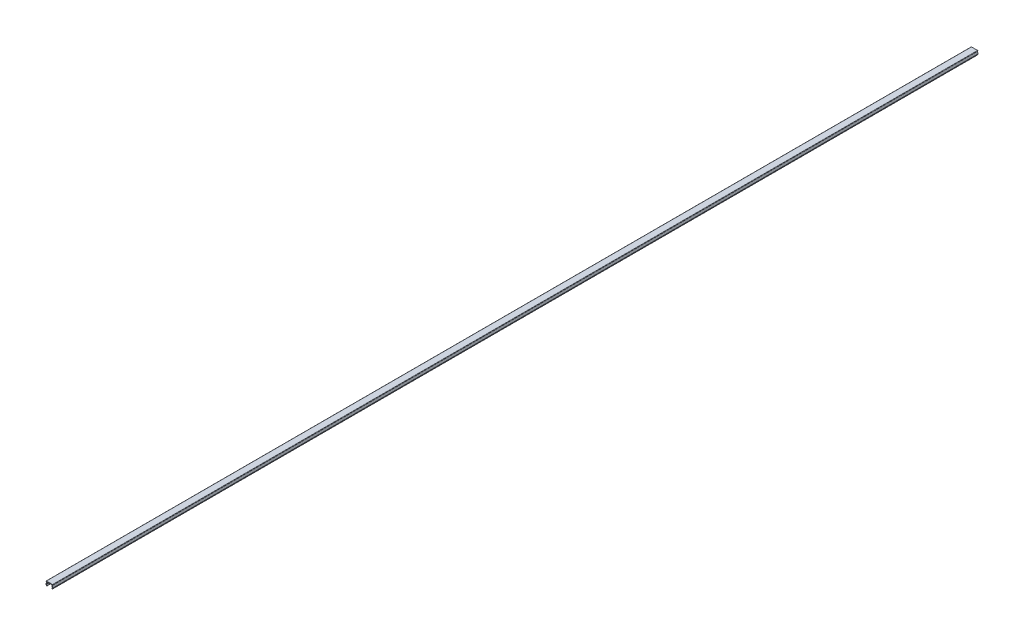
ISO-10303-21;
HEADER;
FILE_DESCRIPTION(('STEP AP214'),'2;1');
FILE_NAME('part.step','',(''),(''),'','','');
FILE_SCHEMA(('AUTOMOTIVE_DESIGN { 1 0 10303 214 1 1 1 1 }'));
ENDSEC;
DATA;
#1=APPLICATION_CONTEXT('core data for automotive mechanical design processes');
#2=APPLICATION_PROTOCOL_DEFINITION('international standard','automotive_design',2000,#1);
#3=PRODUCT_CONTEXT('',#1,'mechanical');
#4=PRODUCT('Part','Part','',(#3));
#5=PRODUCT_RELATED_PRODUCT_CATEGORY('part','',(#4));
#6=PRODUCT_DEFINITION_FORMATION('','',#4);
#7=PRODUCT_DEFINITION_CONTEXT('part definition',#1,'design');
#8=PRODUCT_DEFINITION('design','',#6,#7);
#9=PRODUCT_DEFINITION_SHAPE('','',#8);
#10=(LENGTH_UNIT() NAMED_UNIT(*) SI_UNIT(.MILLI.,.METRE.));
#11=(NAMED_UNIT(*) PLANE_ANGLE_UNIT() SI_UNIT($,.RADIAN.));
#12=(NAMED_UNIT(*) SI_UNIT($,.STERADIAN.) SOLID_ANGLE_UNIT());
#13=UNCERTAINTY_MEASURE_WITH_UNIT(LENGTH_MEASURE(1.E-05),#10,'distance_accuracy_value','');
#14=(GEOMETRIC_REPRESENTATION_CONTEXT(3) GLOBAL_UNCERTAINTY_ASSIGNED_CONTEXT((#13)) GLOBAL_UNIT_ASSIGNED_CONTEXT((#10,
#11,#12)) REPRESENTATION_CONTEXT('',''));
#15=CARTESIAN_POINT('',(0.,0.,0.));
#16=DIRECTION('',(0.,0.,1.));
#17=DIRECTION('',(1.,0.,0.));
#18=AXIS2_PLACEMENT_3D('',#15,#16,#17);
#19=CARTESIAN_POINT('',(-1.32833862518597,3.94999984480356,1000.));
#20=DIRECTION('',(0.,1.,0.));
#21=DIRECTION('',(0.,0.,1.));
#22=AXIS2_PLACEMENT_3D('',#19,#20,#21);
#23=PLANE('',#22);
#24=DIRECTION('',(0.,0.,-1.));
#25=VECTOR('',#24,1.);
#26=CARTESIAN_POINT('',(4.82913663774382,3.94999984480356,1000.));
#27=LINE('',#26,#25);
#28=CARTESIAN_POINT('',(4.82913663774382,3.94999984480356,1000.));
#29=VERTEX_POINT('',#28);
#30=CARTESIAN_POINT('',(4.82913663774382,3.94999984480356,0.));
#31=VERTEX_POINT('',#30);
#32=EDGE_CURVE('E161',#29,#31,#27,.T.);
#33=ORIENTED_EDGE('',*,*,#32,.F.);
#34=DIRECTION('',(1.,0.,0.));
#35=VECTOR('',#34,1.);
#36=CARTESIAN_POINT('',(-1.32833862518597,3.94999984480356,1000.));
#37=LINE('',#36,#35);
#38=CARTESIAN_POINT('',(-0.285813888115763,3.94999984480356,1000.));
#39=VERTEX_POINT('',#38);
#40=EDGE_CURVE('E231',#39,#29,#37,.T.);
#41=ORIENTED_EDGE('',*,*,#40,.F.);
#42=DIRECTION('',(0.,0.,-1.));
#43=VECTOR('',#42,1.);
#44=CARTESIAN_POINT('',(-0.285813888115763,3.94999984480356,1000.));
#45=LINE('',#44,#43);
#46=CARTESIAN_POINT('',(-0.285813888115763,3.94999984480356,0.));
#47=VERTEX_POINT('',#46);
#48=EDGE_CURVE('E244',#39,#47,#45,.T.);
#49=ORIENTED_EDGE('',*,*,#48,.T.);
#50=DIRECTION('',(1.,0.,0.));
#51=VECTOR('',#50,1.);
#52=CARTESIAN_POINT('',(-1.32833862518597,3.94999984480356,0.));
#53=LINE('',#52,#51);
#54=EDGE_CURVE('E239',#47,#31,#53,.T.);
#55=ORIENTED_EDGE('',*,*,#54,.T.);
#56=EDGE_LOOP('',(#33,#41,#49,#55));
#57=FACE_BOUND('',#56,.T.);
#58=ADVANCED_FACE('F15',(#57),#23,.F.);
#59=CARTESIAN_POINT('',(-1.02833862518597,3.94999984480356,1000.));
#60=VERTEX_POINT('',#59);
#61=CARTESIAN_POINT('',(-0.899434790827606,3.94999984480356,1000.));
#62=VERTEX_POINT('',#61);
#63=EDGE_CURVE('E228',#60,#62,#37,.T.);
#64=ORIENTED_EDGE('',*,*,#63,.F.);
#65=DIRECTION('',(0.,0.,-1.));
#66=VECTOR('',#65,1.);
#67=CARTESIAN_POINT('',(-1.02833862518597,3.94999984480356,0.));
#68=LINE('',#67,#66);
#69=CARTESIAN_POINT('',(-1.02833862518597,3.94999984480356,0.));
#70=VERTEX_POINT('',#69);
#71=EDGE_CURVE('E24',#60,#70,#68,.T.);
#72=ORIENTED_EDGE('',*,*,#71,.T.);
#73=CARTESIAN_POINT('',(-0.899434790827606,3.94999984480356,0.));
#74=VERTEX_POINT('',#73);
#75=EDGE_CURVE('E236',#70,#74,#53,.T.);
#76=ORIENTED_EDGE('',*,*,#75,.T.);
#77=DIRECTION('',(0.,0.,-1.));
#78=VECTOR('',#77,1.);
#79=CARTESIAN_POINT('',(-0.899434790827606,3.94999984480356,1000.));
#80=LINE('',#79,#78);
#81=EDGE_CURVE('E235',#62,#74,#80,.T.);
#82=ORIENTED_EDGE('',*,*,#81,.F.);
#83=EDGE_LOOP('',(#64,#72,#76,#82));
#84=FACE_BOUND('',#83,.T.);
#85=ADVANCED_FACE('F317',(#84),#23,.F.);
#86=CARTESIAN_POINT('',(5.44275754045566,3.94999984480356,0.));
#87=VERTEX_POINT('',#86);
#88=CARTESIAN_POINT('',(5.57166137481403,3.94999984480356,0.));
#89=VERTEX_POINT('',#88);
#90=EDGE_CURVE('E227',#87,#89,#53,.T.);
#91=ORIENTED_EDGE('',*,*,#90,.T.);
#92=DIRECTION('',(0.,0.,-1.));
#93=VECTOR('',#92,1.);
#94=CARTESIAN_POINT('',(5.57166137481403,3.94999984480356,1000.));
#95=LINE('',#94,#93);
#96=CARTESIAN_POINT('',(5.57166137481403,3.94999984480356,1000.));
#97=VERTEX_POINT('',#96);
#98=EDGE_CURVE('E9',#89,#97,#95,.F.);
#99=ORIENTED_EDGE('',*,*,#98,.T.);
#100=CARTESIAN_POINT('',(5.44275754045566,3.94999984480356,1000.));
#101=VERTEX_POINT('',#100);
#102=EDGE_CURVE('E232',#101,#97,#37,.T.);
#103=ORIENTED_EDGE('',*,*,#102,.F.);
#104=DIRECTION('',(0.,0.,-1.));
#105=VECTOR('',#104,1.);
#106=CARTESIAN_POINT('',(5.44275754045567,3.94999984480356,1000.));
#107=LINE('',#106,#105);
#108=EDGE_CURVE('E190',#101,#87,#107,.T.);
#109=ORIENTED_EDGE('',*,*,#108,.T.);
#110=EDGE_LOOP('',(#91,#99,#103,#109));
#111=FACE_BOUND('',#110,.T.);
#112=ADVANCED_FACE('F286',(#111),#23,.F.);
#113=CARTESIAN_POINT('',(-1.32833862518597,4.54999984480356,1000.));
#114=DIRECTION('',(0.,1.,0.));
#115=DIRECTION('',(0.,0.,1.));
#116=AXIS2_PLACEMENT_3D('',#113,#114,#115);
#117=PLANE('',#116);
#118=DIRECTION('',(1.,0.,0.));
#119=VECTOR('',#118,1.);
#120=CARTESIAN_POINT('',(-1.32833862518597,4.54999984480356,0.));
#121=LINE('',#120,#119);
#122=CARTESIAN_POINT('',(-1.02833862518597,4.54999984480356,0.));
#123=VERTEX_POINT('',#122);
#124=CARTESIAN_POINT('',(5.57166137481403,4.54999984480356,0.));
#125=VERTEX_POINT('',#124);
#126=EDGE_CURVE('E238',#123,#125,#121,.T.);
#127=ORIENTED_EDGE('',*,*,#126,.F.);
#128=DIRECTION('',(0.,0.,-1.));
#129=VECTOR('',#128,1.);
#130=CARTESIAN_POINT('',(-1.02833862518597,4.54999984480356,1000.));
#131=LINE('',#130,#129);
#132=CARTESIAN_POINT('',(-1.02833862518597,4.54999984480356,1000.));
#133=VERTEX_POINT('',#132);
#134=EDGE_CURVE('E257',#123,#133,#131,.F.);
#135=ORIENTED_EDGE('',*,*,#134,.T.);
#136=DIRECTION('',(1.,0.,0.));
#137=VECTOR('',#136,1.);
#138=CARTESIAN_POINT('',(-1.32833862518597,4.54999984480356,1000.));
#139=LINE('',#138,#137);
#140=CARTESIAN_POINT('',(5.57166137481403,4.54999984480356,1000.));
#141=VERTEX_POINT('',#140);
#142=EDGE_CURVE('E230',#133,#141,#139,.T.);
#143=ORIENTED_EDGE('',*,*,#142,.T.);
#144=DIRECTION('',(0.,0.,-1.));
#145=VECTOR('',#144,1.);
#146=CARTESIAN_POINT('',(5.57166137481403,4.54999984480356,1000.));
#147=LINE('',#146,#145);
#148=EDGE_CURVE('E254',#141,#125,#147,.T.);
#149=ORIENTED_EDGE('',*,*,#148,.T.);
#150=EDGE_LOOP('',(#127,#135,#143,#149));
#151=FACE_BOUND('',#150,.T.);
#152=ADVANCED_FACE('F326',(#151),#117,.T.);
#153=CARTESIAN_POINT('',(0.,0.,1000.));
#154=DIRECTION('',(0.,0.,-1.));
#155=DIRECTION('',(-1.,0.,0.));
#156=AXIS2_PLACEMENT_3D('',#153,#154,#155);
#157=PLANE('',#156);
#158=ORIENTED_EDGE('',*,*,#142,.F.);
#159=CARTESIAN_POINT('',(-1.02833862518597,4.24999984480356,1000.));
#160=DIRECTION('',(0.,0.,-1.));
#161=DIRECTION('',(-1.,0.,0.));
#162=AXIS2_PLACEMENT_3D('',#159,#160,#161);
#163=CIRCLE('',#162,0.3);
#164=CARTESIAN_POINT('',(-1.32833862518597,4.24999984480356,1000.));
#165=VERTEX_POINT('',#164);
#166=EDGE_CURVE('E37',#133,#165,#163,.F.);
#167=ORIENTED_EDGE('',*,*,#166,.T.);
#168=CARTESIAN_POINT('',(-1.02833862518597,4.24999984480356,1000.));
#169=DIRECTION('',(0.,0.,-1.));
#170=DIRECTION('',(-1.,0.,0.));
#171=AXIS2_PLACEMENT_3D('',#168,#169,#170);
#172=CIRCLE('',#171,0.3);
#173=EDGE_CURVE('E32',#165,#60,#172,.F.);
#174=ORIENTED_EDGE('',*,*,#173,.T.);
#175=ORIENTED_EDGE('',*,*,#63,.T.);
#176=DIRECTION('',(-0.209529088730873,-0.97780241407741,0.));
#177=VECTOR('',#176,1.);
#178=CARTESIAN_POINT('',(-0.821679349409193,4.31285857142282,1000.));
#179=LINE('',#178,#177);
#180=CARTESIAN_POINT('',(-1.44301852608376,1.4132757469415,1000.));
#181=VERTEX_POINT('',#180);
#182=EDGE_CURVE('E204',#62,#181,#179,.T.);
#183=ORIENTED_EDGE('',*,*,#182,.T.);
#184=DIRECTION('',(0.429056814568288,-0.90327750435429,0.));
#185=VECTOR('',#184,1.);
#186=CARTESIAN_POINT('',(-1.39932187649226,1.32128280043307,1000.));
#187=LINE('',#186,#185);
#188=CARTESIAN_POINT('',(-0.829321876492257,0.121282800433072,1000.));
#189=VERTEX_POINT('',#188);
#190=EDGE_CURVE('E193',#181,#189,#187,.T.);
#191=ORIENTED_EDGE('',*,*,#190,.T.);
#192=DIRECTION('',(-0.90327750435429,-0.429056814568287,0.));
#193=VECTOR('',#192,1.);
#194=CARTESIAN_POINT('',(-0.287355373879683,0.378716889174045,1000.));
#195=LINE('',#194,#193);
#196=CARTESIAN_POINT('',(-0.287355373879683,0.378716889174045,1000.));
#197=VERTEX_POINT('',#196);
#198=EDGE_CURVE('E195',#197,#189,#195,.T.);
#199=ORIENTED_EDGE('',*,*,#198,.F.);
#200=DIRECTION('',(0.429056814568288,-0.90327750435429,0.));
#201=VECTOR('',#200,1.);
#202=CARTESIAN_POINT('',(-0.857355373879683,1.57871688917404,1000.));
#203=LINE('',#202,#201);
#204=CARTESIAN_POINT('',(-0.813658724288179,1.48672394266561,1000.));
#205=VERTEX_POINT('',#204);
#206=EDGE_CURVE('E199',#205,#197,#203,.T.);
#207=ORIENTED_EDGE('',*,*,#206,.F.);
#208=DIRECTION('',(-0.209529088730873,-0.97780241407741,0.));
#209=VECTOR('',#208,1.);
#210=CARTESIAN_POINT('',(-0.234997900962748,4.1871411181843,1000.));
#211=LINE('',#210,#209);
#212=EDGE_CURVE('E202',#39,#205,#211,.T.);
#213=ORIENTED_EDGE('',*,*,#212,.F.);
#214=ORIENTED_EDGE('',*,*,#40,.T.);
#215=DIRECTION('',(0.209529088730874,-0.97780241407741,0.));
#216=VECTOR('',#215,1.);
#217=CARTESIAN_POINT('',(4.77832065059081,4.1871411181843,1000.));
#218=LINE('',#217,#216);
#219=CARTESIAN_POINT('',(5.35698147391624,1.48672394266562,1000.));
#220=VERTEX_POINT('',#219);
#221=EDGE_CURVE('E147',#29,#220,#218,.T.);
#222=ORIENTED_EDGE('',*,*,#221,.T.);
#223=DIRECTION('',(-0.429056814568288,-0.90327750435429,0.));
#224=VECTOR('',#223,1.);
#225=CARTESIAN_POINT('',(5.40067812350774,1.57871688917405,1000.));
#226=LINE('',#225,#224);
#227=CARTESIAN_POINT('',(4.83067812350774,0.378716889174045,1000.));
#228=VERTEX_POINT('',#227);
#229=EDGE_CURVE('E138',#220,#228,#226,.T.);
#230=ORIENTED_EDGE('',*,*,#229,.T.);
#231=DIRECTION('',(-0.90327750435429,0.429056814568287,0.));
#232=VECTOR('',#231,1.);
#233=CARTESIAN_POINT('',(5.37264462612032,0.121282800433073,1000.));
#234=LINE('',#233,#232);
#235=CARTESIAN_POINT('',(5.37264462612032,0.121282800433073,1000.));
#236=VERTEX_POINT('',#235);
#237=EDGE_CURVE('E143',#236,#228,#234,.T.);
#238=ORIENTED_EDGE('',*,*,#237,.F.);
#239=DIRECTION('',(-0.429056814568288,-0.90327750435429,0.));
#240=VECTOR('',#239,1.);
#241=CARTESIAN_POINT('',(5.94264462612032,1.32128280043307,1000.));
#242=LINE('',#241,#240);
#243=CARTESIAN_POINT('',(5.98634127571182,1.4132757469415,1000.));
#244=VERTEX_POINT('',#243);
#245=EDGE_CURVE('E165',#244,#236,#242,.T.);
#246=ORIENTED_EDGE('',*,*,#245,.F.);
#247=DIRECTION('',(0.209529088730874,-0.97780241407741,0.));
#248=VECTOR('',#247,1.);
#249=CARTESIAN_POINT('',(5.36500209903725,4.31285857142282,1000.));
#250=LINE('',#249,#248);
#251=EDGE_CURVE('E167',#101,#244,#250,.T.);
#252=ORIENTED_EDGE('',*,*,#251,.F.);
#253=ORIENTED_EDGE('',*,*,#102,.T.);
#254=CARTESIAN_POINT('',(5.57166137481403,4.24999984480356,1000.));
#255=DIRECTION('',(0.,0.,-1.));
#256=DIRECTION('',(-1.,0.,0.));
#257=AXIS2_PLACEMENT_3D('',#254,#255,#256);
#258=CIRCLE('',#257,0.3);
#259=CARTESIAN_POINT('',(5.87166137481403,4.24999984480356,1000.));
#260=VERTEX_POINT('',#259);
#261=EDGE_CURVE('E260',#97,#260,#258,.F.);
#262=ORIENTED_EDGE('',*,*,#261,.T.);
#263=CARTESIAN_POINT('',(5.57166137481403,4.24999984480356,1000.));
#264=DIRECTION('',(0.,0.,-1.));
#265=DIRECTION('',(-1.,0.,0.));
#266=AXIS2_PLACEMENT_3D('',#263,#264,#265);
#267=CIRCLE('',#266,0.3);
#268=EDGE_CURVE('E262',#260,#141,#267,.F.);
#269=ORIENTED_EDGE('',*,*,#268,.T.);
#270=EDGE_LOOP('',(#158,#167,#174,#175,#183,#191,#199,#207,#213,#214,#222,#230,#238,#246,#252,
#253,#262,#269));
#271=FACE_BOUND('',#270,.T.);
#272=ADVANCED_FACE('F140',(#271),#157,.F.);
#273=CARTESIAN_POINT('',(0.,0.,0.));
#274=DIRECTION('',(0.,0.,-1.));
#275=DIRECTION('',(-1.,0.,0.));
#276=AXIS2_PLACEMENT_3D('',#273,#274,#275);
#277=PLANE('',#276);
#278=CARTESIAN_POINT('',(-1.02833862518597,4.24999984480356,0.));
#279=DIRECTION('',(0.,0.,-1.));
#280=DIRECTION('',(-1.,0.,0.));
#281=AXIS2_PLACEMENT_3D('',#278,#279,#280);
#282=CIRCLE('',#281,0.3);
#283=CARTESIAN_POINT('',(-1.32833862518597,4.24999984480356,0.));
#284=VERTEX_POINT('',#283);
#285=EDGE_CURVE('E250',#70,#284,#282,.T.);
#286=ORIENTED_EDGE('',*,*,#285,.T.);
#287=CARTESIAN_POINT('',(-1.02833862518597,4.24999984480356,0.));
#288=DIRECTION('',(0.,0.,-1.));
#289=DIRECTION('',(-1.,0.,0.));
#290=AXIS2_PLACEMENT_3D('',#287,#288,#289);
#291=CIRCLE('',#290,0.3);
#292=EDGE_CURVE('E252',#284,#123,#291,.T.);
#293=ORIENTED_EDGE('',*,*,#292,.T.);
#294=ORIENTED_EDGE('',*,*,#126,.T.);
#295=CARTESIAN_POINT('',(5.57166137481403,4.24999984480356,0.));
#296=DIRECTION('',(0.,0.,-1.));
#297=DIRECTION('',(-1.,0.,0.));
#298=AXIS2_PLACEMENT_3D('',#295,#296,#297);
#299=CIRCLE('',#298,0.3);
#300=CARTESIAN_POINT('',(5.87166137481403,4.24999984480356,0.));
#301=VERTEX_POINT('',#300);
#302=EDGE_CURVE('E248',#125,#301,#299,.T.);
#303=ORIENTED_EDGE('',*,*,#302,.T.);
#304=CARTESIAN_POINT('',(5.57166137481403,4.24999984480356,0.));
#305=DIRECTION('',(0.,0.,-1.));
#306=DIRECTION('',(-1.,0.,0.));
#307=AXIS2_PLACEMENT_3D('',#304,#305,#306);
#308=CIRCLE('',#307,0.3);
#309=EDGE_CURVE('E246',#301,#89,#308,.T.);
#310=ORIENTED_EDGE('',*,*,#309,.T.);
#311=ORIENTED_EDGE('',*,*,#90,.F.);
#312=DIRECTION('',(0.209529088730874,-0.97780241407741,0.));
#313=VECTOR('',#312,1.);
#314=CARTESIAN_POINT('',(5.36500209903725,4.31285857142282,0.));
#315=LINE('',#314,#313);
#316=CARTESIAN_POINT('',(5.98634127571182,1.4132757469415,0.));
#317=VERTEX_POINT('',#316);
#318=EDGE_CURVE('E180',#87,#317,#315,.T.);
#319=ORIENTED_EDGE('',*,*,#318,.T.);
#320=DIRECTION('',(-0.429056814568288,-0.90327750435429,0.));
#321=VECTOR('',#320,1.);
#322=CARTESIAN_POINT('',(5.94264462612032,1.32128280043307,0.));
#323=LINE('',#322,#321);
#324=CARTESIAN_POINT('',(5.37264462612032,0.121282800433073,0.));
#325=VERTEX_POINT('',#324);
#326=EDGE_CURVE('E177',#317,#325,#323,.T.);
#327=ORIENTED_EDGE('',*,*,#326,.T.);
#328=DIRECTION('',(-0.90327750435429,0.429056814568287,0.));
#329=VECTOR('',#328,1.);
#330=CARTESIAN_POINT('',(5.37264462612032,0.121282800433073,0.));
#331=LINE('',#330,#329);
#332=CARTESIAN_POINT('',(4.83067812350774,0.378716889174045,0.));
#333=VERTEX_POINT('',#332);
#334=EDGE_CURVE('E174',#325,#333,#331,.T.);
#335=ORIENTED_EDGE('',*,*,#334,.T.);
#336=DIRECTION('',(-0.429056814568288,-0.90327750435429,0.));
#337=VECTOR('',#336,1.);
#338=CARTESIAN_POINT('',(5.40067812350774,1.57871688917405,0.));
#339=LINE('',#338,#337);
#340=CARTESIAN_POINT('',(5.35698147391624,1.48672394266562,0.));
#341=VERTEX_POINT('',#340);
#342=EDGE_CURVE('E157',#341,#333,#339,.T.);
#343=ORIENTED_EDGE('',*,*,#342,.F.);
#344=DIRECTION('',(0.209529088730874,-0.97780241407741,0.));
#345=VECTOR('',#344,1.);
#346=CARTESIAN_POINT('',(4.77832065059081,4.1871411181843,0.));
#347=LINE('',#346,#345);
#348=EDGE_CURVE('E151',#31,#341,#347,.T.);
#349=ORIENTED_EDGE('',*,*,#348,.F.);
#350=ORIENTED_EDGE('',*,*,#54,.F.);
#351=DIRECTION('',(-0.209529088730873,-0.97780241407741,0.));
#352=VECTOR('',#351,1.);
#353=CARTESIAN_POINT('',(-0.234997900962748,4.1871411181843,0.));
#354=LINE('',#353,#352);
#355=CARTESIAN_POINT('',(-0.813658724288179,1.48672394266561,0.));
#356=VERTEX_POINT('',#355);
#357=EDGE_CURVE('E215',#47,#356,#354,.T.);
#358=ORIENTED_EDGE('',*,*,#357,.T.);
#359=DIRECTION('',(0.429056814568288,-0.90327750435429,0.));
#360=VECTOR('',#359,1.);
#361=CARTESIAN_POINT('',(-0.857355373879683,1.57871688917404,0.));
#362=LINE('',#361,#360);
#363=CARTESIAN_POINT('',(-0.287355373879683,0.378716889174045,0.));
#364=VERTEX_POINT('',#363);
#365=EDGE_CURVE('E212',#356,#364,#362,.T.);
#366=ORIENTED_EDGE('',*,*,#365,.T.);
#367=DIRECTION('',(-0.90327750435429,-0.429056814568287,0.));
#368=VECTOR('',#367,1.);
#369=CARTESIAN_POINT('',(-0.287355373879683,0.378716889174045,0.));
#370=LINE('',#369,#368);
#371=CARTESIAN_POINT('',(-0.829321876492257,0.121282800433072,0.));
#372=VERTEX_POINT('',#371);
#373=EDGE_CURVE('E209',#364,#372,#370,.T.);
#374=ORIENTED_EDGE('',*,*,#373,.T.);
#375=DIRECTION('',(0.429056814568288,-0.90327750435429,0.));
#376=VECTOR('',#375,1.);
#377=CARTESIAN_POINT('',(-1.39932187649226,1.32128280043307,0.));
#378=LINE('',#377,#376);
#379=CARTESIAN_POINT('',(-1.44301852608376,1.4132757469415,0.));
#380=VERTEX_POINT('',#379);
#381=EDGE_CURVE('E192',#380,#372,#378,.T.);
#382=ORIENTED_EDGE('',*,*,#381,.F.);
#383=DIRECTION('',(-0.209529088730873,-0.97780241407741,0.));
#384=VECTOR('',#383,1.);
#385=CARTESIAN_POINT('',(-0.821679349409193,4.31285857142282,0.));
#386=LINE('',#385,#384);
#387=EDGE_CURVE('E196',#74,#380,#386,.T.);
#388=ORIENTED_EDGE('',*,*,#387,.F.);
#389=ORIENTED_EDGE('',*,*,#75,.F.);
#390=EDGE_LOOP('',(#286,#293,#294,#303,#310,#311,#319,#327,#335,#343,#349,#350,#358,#366,#374,
#382,#388,#389));
#391=FACE_BOUND('',#390,.T.);
#392=ADVANCED_FACE('F283',(#391),#277,.T.);
#393=CARTESIAN_POINT('',(-0.234997900962748,4.1871411181843,1000.));
#394=DIRECTION('',(0.97780241407741,-0.209529088730873,0.));
#395=DIRECTION('',(0.209529088730873,0.97780241407741,0.));
#396=AXIS2_PLACEMENT_3D('',#393,#394,#395);
#397=PLANE('',#396);
#398=ORIENTED_EDGE('',*,*,#48,.F.);
#399=ORIENTED_EDGE('',*,*,#212,.T.);
#400=DIRECTION('',(0.,0.,-1.));
#401=VECTOR('',#400,1.);
#402=CARTESIAN_POINT('',(-0.813658724288179,1.48672394266561,1000.));
#403=LINE('',#402,#401);
#404=EDGE_CURVE('E220',#205,#356,#403,.T.);
#405=ORIENTED_EDGE('',*,*,#404,.T.);
#406=ORIENTED_EDGE('',*,*,#357,.F.);
#407=EDGE_LOOP('',(#398,#399,#405,#406));
#408=FACE_BOUND('',#407,.T.);
#409=ADVANCED_FACE('F338',(#408),#397,.T.);
#410=CARTESIAN_POINT('',(-0.821679349409193,4.31285857142282,1000.));
#411=DIRECTION('',(0.97780241407741,-0.209529088730873,0.));
#412=DIRECTION('',(0.209529088730873,0.97780241407741,0.));
#413=AXIS2_PLACEMENT_3D('',#410,#411,#412);
#414=PLANE('',#413);
#415=ORIENTED_EDGE('',*,*,#182,.F.);
#416=ORIENTED_EDGE('',*,*,#81,.T.);
#417=ORIENTED_EDGE('',*,*,#387,.T.);
#418=DIRECTION('',(0.,0.,-1.));
#419=VECTOR('',#418,1.);
#420=CARTESIAN_POINT('',(-1.44301852608376,1.4132757469415,1000.));
#421=LINE('',#420,#419);
#422=EDGE_CURVE('E206',#181,#380,#421,.T.);
#423=ORIENTED_EDGE('',*,*,#422,.F.);
#424=EDGE_LOOP('',(#415,#416,#417,#423));
#425=FACE_BOUND('',#424,.T.);
#426=ADVANCED_FACE('F343',(#425),#414,.F.);
#427=CARTESIAN_POINT('',(-1.39932187649226,1.32128280043307,1000.));
#428=DIRECTION('',(0.90327750435429,0.429056814568288,0.));
#429=DIRECTION('',(-0.429056814568288,0.90327750435429,0.));
#430=AXIS2_PLACEMENT_3D('',#427,#428,#429);
#431=PLANE('',#430);
#432=ORIENTED_EDGE('',*,*,#381,.T.);
#433=DIRECTION('',(0.,0.,-1.));
#434=VECTOR('',#433,1.);
#435=CARTESIAN_POINT('',(-0.829321876492257,0.121282800433072,1000.));
#436=LINE('',#435,#434);
#437=EDGE_CURVE('E225',#189,#372,#436,.T.);
#438=ORIENTED_EDGE('',*,*,#437,.F.);
#439=ORIENTED_EDGE('',*,*,#190,.F.);
#440=ORIENTED_EDGE('',*,*,#422,.T.);
#441=EDGE_LOOP('',(#432,#438,#439,#440));
#442=FACE_BOUND('',#441,.T.);
#443=ADVANCED_FACE('F340',(#442),#431,.F.);
#444=CARTESIAN_POINT('',(-0.287355373879683,0.378716889174045,1000.));
#445=DIRECTION('',(0.429056814568288,-0.90327750435429,0.));
#446=DIRECTION('',(0.90327750435429,0.429056814568287,0.));
#447=AXIS2_PLACEMENT_3D('',#444,#445,#446);
#448=PLANE('',#447);
#449=ORIENTED_EDGE('',*,*,#373,.F.);
#450=DIRECTION('',(0.,0.,-1.));
#451=VECTOR('',#450,1.);
#452=CARTESIAN_POINT('',(-0.287355373879683,0.378716889174045,1000.));
#453=LINE('',#452,#451);
#454=EDGE_CURVE('E223',#197,#364,#453,.T.);
#455=ORIENTED_EDGE('',*,*,#454,.F.);
#456=ORIENTED_EDGE('',*,*,#198,.T.);
#457=ORIENTED_EDGE('',*,*,#437,.T.);
#458=EDGE_LOOP('',(#449,#455,#456,#457));
#459=FACE_BOUND('',#458,.T.);
#460=ADVANCED_FACE('F312',(#459),#448,.T.);
#461=CARTESIAN_POINT('',(-0.857355373879683,1.57871688917404,1000.));
#462=DIRECTION('',(0.90327750435429,0.429056814568288,0.));
#463=DIRECTION('',(-0.429056814568288,0.90327750435429,0.));
#464=AXIS2_PLACEMENT_3D('',#461,#462,#463);
#465=PLANE('',#464);
#466=ORIENTED_EDGE('',*,*,#365,.F.);
#467=ORIENTED_EDGE('',*,*,#404,.F.);
#468=ORIENTED_EDGE('',*,*,#206,.T.);
#469=ORIENTED_EDGE('',*,*,#454,.T.);
#470=EDGE_LOOP('',(#466,#467,#468,#469));
#471=FACE_BOUND('',#470,.T.);
#472=ADVANCED_FACE('F304',(#471),#465,.T.);
#473=CARTESIAN_POINT('',(5.36500209903725,4.31285857142282,1000.));
#474=DIRECTION('',(0.97780241407741,0.209529088730874,0.));
#475=DIRECTION('',(-0.209529088730874,0.97780241407741,0.));
#476=AXIS2_PLACEMENT_3D('',#473,#474,#475);
#477=PLANE('',#476);
#478=ORIENTED_EDGE('',*,*,#108,.F.);
#479=ORIENTED_EDGE('',*,*,#251,.T.);
#480=DIRECTION('',(0.,0.,-1.));
#481=VECTOR('',#480,1.);
#482=CARTESIAN_POINT('',(5.98634127571182,1.4132757469415,1000.));
#483=LINE('',#482,#481);
#484=EDGE_CURVE('E184',#244,#317,#483,.T.);
#485=ORIENTED_EDGE('',*,*,#484,.T.);
#486=ORIENTED_EDGE('',*,*,#318,.F.);
#487=EDGE_LOOP('',(#478,#479,#485,#486));
#488=FACE_BOUND('',#487,.T.);
#489=ADVANCED_FACE('F302',(#488),#477,.T.);
#490=CARTESIAN_POINT('',(4.77832065059081,4.1871411181843,1000.));
#491=DIRECTION('',(0.97780241407741,0.209529088730874,0.));
#492=DIRECTION('',(-0.209529088730874,0.97780241407741,0.));
#493=AXIS2_PLACEMENT_3D('',#490,#491,#492);
#494=PLANE('',#493);
#495=ORIENTED_EDGE('',*,*,#221,.F.);
#496=ORIENTED_EDGE('',*,*,#32,.T.);
#497=ORIENTED_EDGE('',*,*,#348,.T.);
#498=DIRECTION('',(0.,0.,-1.));
#499=VECTOR('',#498,1.);
#500=CARTESIAN_POINT('',(5.35698147391624,1.48672394266562,1000.));
#501=LINE('',#500,#499);
#502=EDGE_CURVE('E172',#220,#341,#501,.T.);
#503=ORIENTED_EDGE('',*,*,#502,.F.);
#504=EDGE_LOOP('',(#495,#496,#497,#503));
#505=FACE_BOUND('',#504,.T.);
#506=ADVANCED_FACE('F295',(#505),#494,.F.);
#507=CARTESIAN_POINT('',(5.40067812350774,1.57871688917405,1000.));
#508=DIRECTION('',(0.90327750435429,-0.429056814568288,0.));
#509=DIRECTION('',(0.429056814568288,0.90327750435429,0.));
#510=AXIS2_PLACEMENT_3D('',#507,#508,#509);
#511=PLANE('',#510);
#512=ORIENTED_EDGE('',*,*,#342,.T.);
#513=DIRECTION('',(0.,0.,-1.));
#514=VECTOR('',#513,1.);
#515=CARTESIAN_POINT('',(4.83067812350774,0.378716889174045,1000.));
#516=LINE('',#515,#514);
#517=EDGE_CURVE('E154',#228,#333,#516,.T.);
#518=ORIENTED_EDGE('',*,*,#517,.F.);
#519=ORIENTED_EDGE('',*,*,#229,.F.);
#520=ORIENTED_EDGE('',*,*,#502,.T.);
#521=EDGE_LOOP('',(#512,#518,#519,#520));
#522=FACE_BOUND('',#521,.T.);
#523=ADVANCED_FACE('F155',(#522),#511,.F.);
#524=CARTESIAN_POINT('',(5.37264462612032,0.121282800433073,1000.));
#525=DIRECTION('',(-0.429056814568287,-0.90327750435429,0.));
#526=DIRECTION('',(0.90327750435429,-0.429056814568287,0.));
#527=AXIS2_PLACEMENT_3D('',#524,#525,#526);
#528=PLANE('',#527);
#529=ORIENTED_EDGE('',*,*,#334,.F.);
#530=DIRECTION('',(0.,0.,-1.));
#531=VECTOR('',#530,1.);
#532=CARTESIAN_POINT('',(5.37264462612032,0.121282800433073,1000.));
#533=LINE('',#532,#531);
#534=EDGE_CURVE('E162',#236,#325,#533,.T.);
#535=ORIENTED_EDGE('',*,*,#534,.F.);
#536=ORIENTED_EDGE('',*,*,#237,.T.);
#537=ORIENTED_EDGE('',*,*,#517,.T.);
#538=EDGE_LOOP('',(#529,#535,#536,#537));
#539=FACE_BOUND('',#538,.T.);
#540=ADVANCED_FACE('F164',(#539),#528,.T.);
#541=CARTESIAN_POINT('',(5.94264462612032,1.32128280043307,1000.));
#542=DIRECTION('',(0.90327750435429,-0.429056814568288,0.));
#543=DIRECTION('',(0.429056814568288,0.90327750435429,0.));
#544=AXIS2_PLACEMENT_3D('',#541,#542,#543);
#545=PLANE('',#544);
#546=ORIENTED_EDGE('',*,*,#326,.F.);
#547=ORIENTED_EDGE('',*,*,#484,.F.);
#548=ORIENTED_EDGE('',*,*,#245,.T.);
#549=ORIENTED_EDGE('',*,*,#534,.T.);
#550=EDGE_LOOP('',(#546,#547,#548,#549));
#551=FACE_BOUND('',#550,.T.);
#552=ADVANCED_FACE('F299',(#551),#545,.T.);
#553=CARTESIAN_POINT('',(-1.02833862518597,4.24999984480356,1000.));
#554=DIRECTION('',(0.,0.,1.));
#555=DIRECTION('',(1.,0.,0.));
#556=AXIS2_PLACEMENT_3D('',#553,#554,#555);
#557=CYLINDRICAL_SURFACE('',#556,0.3);
#558=ORIENTED_EDGE('',*,*,#71,.F.);
#559=ORIENTED_EDGE('',*,*,#173,.F.);
#560=DIRECTION('',(0.,0.,-1.));
#561=VECTOR('',#560,1.);
#562=CARTESIAN_POINT('',(-1.32833862518597,4.24999984480356,1000.));
#563=LINE('',#562,#561);
#564=EDGE_CURVE('E175',#284,#165,#563,.F.);
#565=ORIENTED_EDGE('',*,*,#564,.F.);
#566=ORIENTED_EDGE('',*,*,#285,.F.);
#567=EDGE_LOOP('',(#558,#559,#565,#566));
#568=FACE_BOUND('',#567,.T.);
#569=ADVANCED_FACE('F358',(#568),#557,.T.);
#570=CARTESIAN_POINT('',(-1.02833862518597,4.24999984480356,1000.));
#571=DIRECTION('',(0.,0.,-1.));
#572=DIRECTION('',(-1.,0.,0.));
#573=AXIS2_PLACEMENT_3D('',#570,#571,#572);
#574=CYLINDRICAL_SURFACE('',#573,0.3);
#575=ORIENTED_EDGE('',*,*,#166,.F.);
#576=ORIENTED_EDGE('',*,*,#134,.F.);
#577=ORIENTED_EDGE('',*,*,#292,.F.);
#578=ORIENTED_EDGE('',*,*,#564,.T.);
#579=EDGE_LOOP('',(#575,#576,#577,#578));
#580=FACE_BOUND('',#579,.T.);
#581=ADVANCED_FACE('F362',(#580),#574,.T.);
#582=CARTESIAN_POINT('',(5.57166137481403,4.24999984480356,1000.));
#583=DIRECTION('',(0.,0.,1.));
#584=DIRECTION('',(1.,0.,0.));
#585=AXIS2_PLACEMENT_3D('',#582,#583,#584);
#586=CYLINDRICAL_SURFACE('',#585,0.3);
#587=DIRECTION('',(0.,0.,-1.));
#588=VECTOR('',#587,1.);
#589=CARTESIAN_POINT('',(5.87166137481403,4.24999984480356,0.));
#590=LINE('',#589,#588);
#591=EDGE_CURVE('E19',#260,#301,#590,.T.);
#592=ORIENTED_EDGE('',*,*,#591,.F.);
#593=ORIENTED_EDGE('',*,*,#261,.F.);
#594=ORIENTED_EDGE('',*,*,#98,.F.);
#595=ORIENTED_EDGE('',*,*,#309,.F.);
#596=EDGE_LOOP('',(#592,#593,#594,#595));
#597=FACE_BOUND('',#596,.T.);
#598=ADVANCED_FACE('F17',(#597),#586,.T.);
#599=CARTESIAN_POINT('',(5.57166137481403,4.24999984480356,1000.));
#600=DIRECTION('',(0.,0.,-1.));
#601=DIRECTION('',(-1.,0.,0.));
#602=AXIS2_PLACEMENT_3D('',#599,#600,#601);
#603=CYLINDRICAL_SURFACE('',#602,0.3);
#604=ORIENTED_EDGE('',*,*,#268,.F.);
#605=ORIENTED_EDGE('',*,*,#591,.T.);
#606=ORIENTED_EDGE('',*,*,#302,.F.);
#607=ORIENTED_EDGE('',*,*,#148,.F.);
#608=EDGE_LOOP('',(#604,#605,#606,#607));
#609=FACE_BOUND('',#608,.T.);
#610=ADVANCED_FACE('F274',(#609),#603,.T.);
#611=CLOSED_SHELL('',(#58,#85,#112,#152,#272,#392,#409,#426,#443,#460,#472,#489,#506,#523,#540,
#552,#569,#581,#598,#610));
#612=MANIFOLD_SOLID_BREP('B1',#611);
#613=ADVANCED_BREP_SHAPE_REPRESENTATION('',(#18,#612),#14);
#614=SHAPE_DEFINITION_REPRESENTATION(#9,#613);
ENDSEC;
END-ISO-10303-21;
